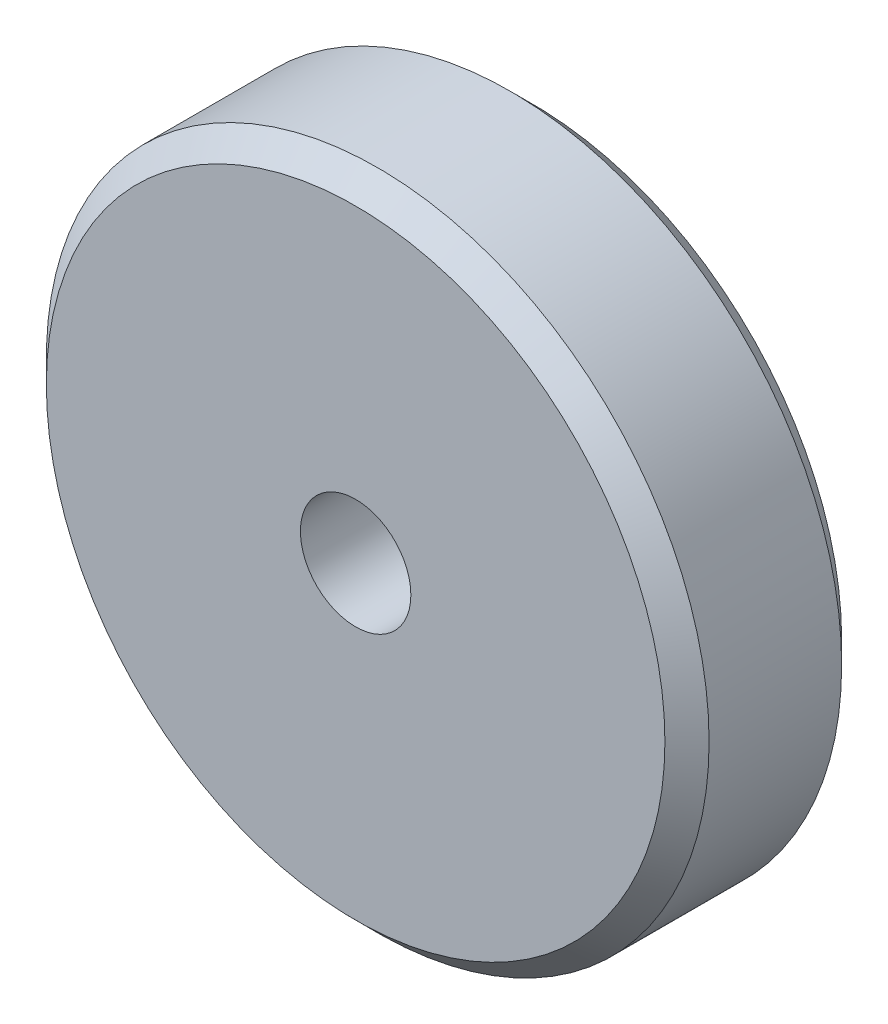
ISO-10303-21;
HEADER;
FILE_DESCRIPTION(('STEP AP214'),'2;1');
FILE_NAME('part.step','',(''),(''),'','','');
FILE_SCHEMA(('AUTOMOTIVE_DESIGN { 1 0 10303 214 1 1 1 1 }'));
ENDSEC;
DATA;
#1=APPLICATION_CONTEXT('core data for automotive mechanical design processes');
#2=APPLICATION_PROTOCOL_DEFINITION('international standard','automotive_design',2000,#1);
#3=PRODUCT_CONTEXT('',#1,'mechanical');
#4=PRODUCT('Part','Part','',(#3));
#5=PRODUCT_RELATED_PRODUCT_CATEGORY('part','',(#4));
#6=PRODUCT_DEFINITION_FORMATION('','',#4);
#7=PRODUCT_DEFINITION_CONTEXT('part definition',#1,'design');
#8=PRODUCT_DEFINITION('design','',#6,#7);
#9=PRODUCT_DEFINITION_SHAPE('','',#8);
#10=(LENGTH_UNIT() NAMED_UNIT(*) SI_UNIT(.MILLI.,.METRE.));
#11=(NAMED_UNIT(*) PLANE_ANGLE_UNIT() SI_UNIT($,.RADIAN.));
#12=(NAMED_UNIT(*) SI_UNIT($,.STERADIAN.) SOLID_ANGLE_UNIT());
#13=UNCERTAINTY_MEASURE_WITH_UNIT(LENGTH_MEASURE(1.E-05),#10,'distance_accuracy_value','');
#14=(GEOMETRIC_REPRESENTATION_CONTEXT(3) GLOBAL_UNCERTAINTY_ASSIGNED_CONTEXT((#13)) GLOBAL_UNIT_ASSIGNED_CONTEXT((#10,
#11,#12)) REPRESENTATION_CONTEXT('',''));
#15=CARTESIAN_POINT('',(0.,0.,0.));
#16=DIRECTION('',(0.,0.,1.));
#17=DIRECTION('',(1.,0.,0.));
#18=AXIS2_PLACEMENT_3D('',#15,#16,#17);
#19=CARTESIAN_POINT('',(0.,0.,8.));
#20=DIRECTION('',(0.,0.,1.));
#21=DIRECTION('',(1.,0.,0.));
#22=AXIS2_PLACEMENT_3D('',#19,#20,#21);
#23=PLANE('',#22);
#24=CARTESIAN_POINT('',(0.,0.,8.));
#25=DIRECTION('',(0.,0.,1.));
#26=DIRECTION('',(1.,0.,0.));
#27=AXIS2_PLACEMENT_3D('',#24,#25,#26);
#28=CIRCLE('',#27,14.);
#29=CARTESIAN_POINT('',(14.,0.,8.));
#30=VERTEX_POINT('',#29);
#31=EDGE_CURVE('E10',#30,#30,#28,.T.);
#32=ORIENTED_EDGE('',*,*,#31,.T.);
#33=EDGE_LOOP('',(#32));
#34=FACE_BOUND('',#33,.T.);
#35=CARTESIAN_POINT('',(0.,0.,8.));
#36=DIRECTION('',(0.,0.,1.));
#37=DIRECTION('',(1.,0.,0.));
#38=AXIS2_PLACEMENT_3D('',#35,#36,#37);
#39=CIRCLE('',#38,2.5);
#40=CARTESIAN_POINT('',(2.5,0.,8.));
#41=VERTEX_POINT('',#40);
#42=EDGE_CURVE('E51',#41,#41,#39,.T.);
#43=ORIENTED_EDGE('',*,*,#42,.F.);
#44=EDGE_LOOP('',(#43));
#45=FACE_BOUND('',#44,.T.);
#46=ADVANCED_FACE('F31',(#34,#45),#23,.T.);
#47=CARTESIAN_POINT('',(0.,0.,0.));
#48=DIRECTION('',(0.,0.,1.));
#49=DIRECTION('',(1.,0.,0.));
#50=AXIS2_PLACEMENT_3D('',#47,#48,#49);
#51=PLANE('',#50);
#52=CARTESIAN_POINT('',(0.,0.,0.));
#53=DIRECTION('',(0.,0.,1.));
#54=DIRECTION('',(1.,0.,0.));
#55=AXIS2_PLACEMENT_3D('',#52,#53,#54);
#56=CIRCLE('',#55,14.);
#57=CARTESIAN_POINT('',(14.,0.,0.));
#58=VERTEX_POINT('',#57);
#59=EDGE_CURVE('E38',#58,#58,#56,.F.);
#60=ORIENTED_EDGE('',*,*,#59,.T.);
#61=EDGE_LOOP('',(#60));
#62=FACE_BOUND('',#61,.T.);
#63=CARTESIAN_POINT('',(0.,0.,0.));
#64=DIRECTION('',(0.,0.,1.));
#65=DIRECTION('',(1.,0.,0.));
#66=AXIS2_PLACEMENT_3D('',#63,#64,#65);
#67=CIRCLE('',#66,2.5);
#68=CARTESIAN_POINT('',(2.5,0.,0.));
#69=VERTEX_POINT('',#68);
#70=EDGE_CURVE('E52',#69,#69,#67,.T.);
#71=ORIENTED_EDGE('',*,*,#70,.T.);
#72=EDGE_LOOP('',(#71));
#73=FACE_BOUND('',#72,.T.);
#74=ADVANCED_FACE('F62',(#62,#73),#51,.F.);
#75=CARTESIAN_POINT('',(0.,0.,8.));
#76=DIRECTION('',(0.,0.,-1.));
#77=DIRECTION('',(-1.,0.,0.));
#78=AXIS2_PLACEMENT_3D('',#75,#76,#77);
#79=CYLINDRICAL_SURFACE('',#78,15.);
#80=CARTESIAN_POINT('',(0.,0.,1.));
#81=DIRECTION('',(0.,0.,1.));
#82=DIRECTION('',(1.,0.,0.));
#83=AXIS2_PLACEMENT_3D('',#80,#81,#82);
#84=CIRCLE('',#83,15.);
#85=CARTESIAN_POINT('',(15.,0.,1.));
#86=VERTEX_POINT('',#85);
#87=EDGE_CURVE('E42',#86,#86,#84,.T.);
#88=ORIENTED_EDGE('',*,*,#87,.T.);
#89=EDGE_LOOP('',(#88));
#90=FACE_BOUND('',#89,.T.);
#91=CARTESIAN_POINT('',(0.,0.,7.));
#92=DIRECTION('',(0.,0.,1.));
#93=DIRECTION('',(1.,0.,0.));
#94=AXIS2_PLACEMENT_3D('',#91,#92,#93);
#95=CIRCLE('',#94,15.);
#96=CARTESIAN_POINT('',(15.,0.,7.));
#97=VERTEX_POINT('',#96);
#98=EDGE_CURVE('E46',#97,#97,#95,.F.);
#99=ORIENTED_EDGE('',*,*,#98,.T.);
#100=EDGE_LOOP('',(#99));
#101=FACE_BOUND('',#100,.T.);
#102=ADVANCED_FACE('F68',(#90,#101),#79,.T.);
#103=CARTESIAN_POINT('',(0.,0.,8.));
#104=DIRECTION('',(0.,0.,-1.));
#105=DIRECTION('',(-1.,0.,0.));
#106=AXIS2_PLACEMENT_3D('',#103,#104,#105);
#107=CYLINDRICAL_SURFACE('',#106,2.5);
#108=ORIENTED_EDGE('',*,*,#42,.T.);
#109=EDGE_LOOP('',(#108));
#110=FACE_BOUND('',#109,.T.);
#111=ORIENTED_EDGE('',*,*,#70,.F.);
#112=EDGE_LOOP('',(#111));
#113=FACE_BOUND('',#112,.T.);
#114=ADVANCED_FACE('F58',(#110,#113),#107,.F.);
#115=CARTESIAN_POINT('',(0.,0.,1.));
#116=DIRECTION('',(0.,0.,1.));
#117=DIRECTION('',(1.,0.,0.));
#118=AXIS2_PLACEMENT_3D('',#115,#116,#117);
#119=CONICAL_SURFACE('',#118,15.,0.785398163397452);
#120=ORIENTED_EDGE('',*,*,#59,.F.);
#121=EDGE_LOOP('',(#120));
#122=FACE_BOUND('',#121,.T.);
#123=ORIENTED_EDGE('',*,*,#87,.F.);
#124=EDGE_LOOP('',(#123));
#125=FACE_BOUND('',#124,.T.);
#126=ADVANCED_FACE('F74',(#122,#125),#119,.T.);
#127=CARTESIAN_POINT('',(0.,0.,8.));
#128=DIRECTION('',(0.,0.,-1.));
#129=DIRECTION('',(-1.,0.,0.));
#130=AXIS2_PLACEMENT_3D('',#127,#128,#129);
#131=CONICAL_SURFACE('',#130,14.,0.785398163397447);
#132=ORIENTED_EDGE('',*,*,#98,.F.);
#133=EDGE_LOOP('',(#132));
#134=FACE_BOUND('',#133,.T.);
#135=ORIENTED_EDGE('',*,*,#31,.F.);
#136=EDGE_LOOP('',(#135));
#137=FACE_BOUND('',#136,.T.);
#138=ADVANCED_FACE('F33',(#134,#137),#131,.T.);
#139=CLOSED_SHELL('',(#46,#74,#102,#114,#126,#138));
#140=MANIFOLD_SOLID_BREP('B2',#139);
#141=ADVANCED_BREP_SHAPE_REPRESENTATION('',(#18,#140),#14);
#142=SHAPE_DEFINITION_REPRESENTATION(#9,#141);
ENDSEC;
END-ISO-10303-21;
